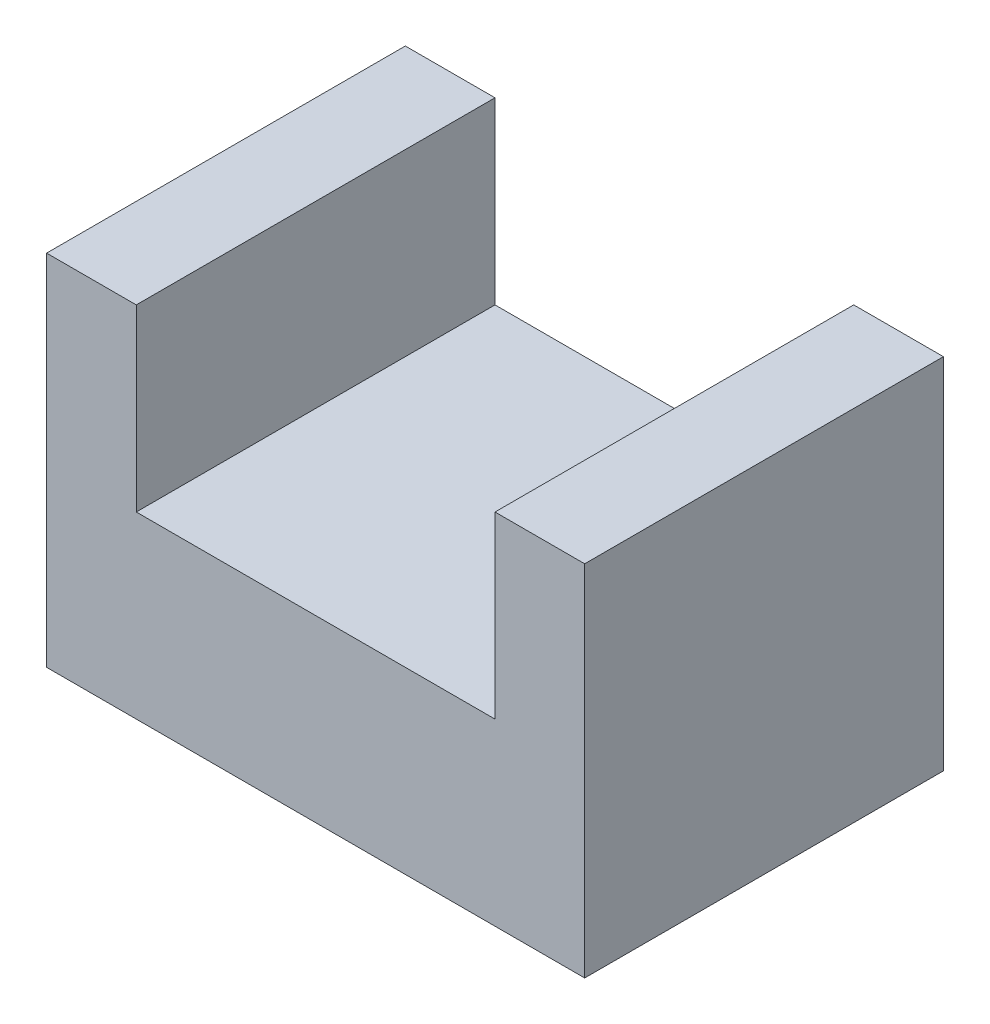
ISO-10303-21;
HEADER;
FILE_DESCRIPTION(('STEP AP214'),'2;1');
FILE_NAME('part.step','',(''),(''),'','','');
FILE_SCHEMA(('AUTOMOTIVE_DESIGN { 1 0 10303 214 1 1 1 1 }'));
ENDSEC;
DATA;
#1=APPLICATION_CONTEXT('core data for automotive mechanical design processes');
#2=APPLICATION_PROTOCOL_DEFINITION('international standard','automotive_design',2000,#1);
#3=PRODUCT_CONTEXT('',#1,'mechanical');
#4=PRODUCT('Part','Part','',(#3));
#5=PRODUCT_RELATED_PRODUCT_CATEGORY('part','',(#4));
#6=PRODUCT_DEFINITION_FORMATION('','',#4);
#7=PRODUCT_DEFINITION_CONTEXT('part definition',#1,'design');
#8=PRODUCT_DEFINITION('design','',#6,#7);
#9=PRODUCT_DEFINITION_SHAPE('','',#8);
#10=(LENGTH_UNIT() NAMED_UNIT(*) SI_UNIT(.MILLI.,.METRE.));
#11=(NAMED_UNIT(*) PLANE_ANGLE_UNIT() SI_UNIT($,.RADIAN.));
#12=(NAMED_UNIT(*) SI_UNIT($,.STERADIAN.) SOLID_ANGLE_UNIT());
#13=UNCERTAINTY_MEASURE_WITH_UNIT(LENGTH_MEASURE(1.E-05),#10,'distance_accuracy_value','');
#14=(GEOMETRIC_REPRESENTATION_CONTEXT(3) GLOBAL_UNCERTAINTY_ASSIGNED_CONTEXT((#13)) GLOBAL_UNIT_ASSIGNED_CONTEXT((#10,
#11,#12)) REPRESENTATION_CONTEXT('',''));
#15=CARTESIAN_POINT('',(0.,0.,0.));
#16=DIRECTION('',(0.,0.,1.));
#17=DIRECTION('',(1.,0.,0.));
#18=AXIS2_PLACEMENT_3D('',#15,#16,#17);
#19=CARTESIAN_POINT('',(-23.9150769230769,37.0449230769231,50.8));
#20=DIRECTION('',(0.,-1.,0.));
#21=DIRECTION('',(0.,0.,-1.));
#22=AXIS2_PLACEMENT_3D('',#19,#20,#21);
#23=PLANE('',#22);
#24=DIRECTION('',(-1.,0.,0.));
#25=VECTOR('',#24,1.);
#26=CARTESIAN_POINT('',(-23.9150769230769,37.0449230769231,0.));
#27=LINE('',#26,#25);
#28=CARTESIAN_POINT('',(-23.9150769230769,37.0449230769231,0.));
#29=VERTEX_POINT('',#28);
#30=CARTESIAN_POINT('',(-36.6150769230769,37.0449230769231,0.));
#31=VERTEX_POINT('',#30);
#32=EDGE_CURVE('E128',#29,#31,#27,.T.);
#33=ORIENTED_EDGE('',*,*,#32,.T.);
#34=DIRECTION('',(0.,0.,-1.));
#35=VECTOR('',#34,1.);
#36=CARTESIAN_POINT('',(-36.6150769230769,37.0449230769231,50.8));
#37=LINE('',#36,#35);
#38=CARTESIAN_POINT('',(-36.6150769230769,37.0449230769231,50.8));
#39=VERTEX_POINT('',#38);
#40=EDGE_CURVE('E11',#39,#31,#37,.T.);
#41=ORIENTED_EDGE('',*,*,#40,.F.);
#42=DIRECTION('',(-1.,0.,0.));
#43=VECTOR('',#42,1.);
#44=CARTESIAN_POINT('',(-23.9150769230769,37.0449230769231,50.8));
#45=LINE('',#44,#43);
#46=CARTESIAN_POINT('',(-23.9150769230769,37.0449230769231,50.8));
#47=VERTEX_POINT('',#46);
#48=EDGE_CURVE('E142',#47,#39,#45,.T.);
#49=ORIENTED_EDGE('',*,*,#48,.F.);
#50=DIRECTION('',(0.,0.,-1.));
#51=VECTOR('',#50,1.);
#52=CARTESIAN_POINT('',(-23.9150769230769,37.0449230769231,50.8));
#53=LINE('',#52,#51);
#54=EDGE_CURVE('E124',#47,#29,#53,.T.);
#55=ORIENTED_EDGE('',*,*,#54,.T.);
#56=EDGE_LOOP('',(#33,#41,#49,#55));
#57=FACE_BOUND('',#56,.T.);
#58=ADVANCED_FACE('F32',(#57),#23,.F.);
#59=CARTESIAN_POINT('',(-36.6150769230769,37.0449230769231,50.8));
#60=DIRECTION('',(1.,0.,0.));
#61=DIRECTION('',(0.,0.,-1.));
#62=AXIS2_PLACEMENT_3D('',#59,#60,#61);
#63=PLANE('',#62);
#64=DIRECTION('',(0.,-1.,0.));
#65=VECTOR('',#64,1.);
#66=CARTESIAN_POINT('',(-36.6150769230769,37.0449230769231,0.));
#67=LINE('',#66,#65);
#68=CARTESIAN_POINT('',(-36.6150769230769,-13.7550769230769,0.));
#69=VERTEX_POINT('',#68);
#70=EDGE_CURVE('E131',#31,#69,#67,.T.);
#71=ORIENTED_EDGE('',*,*,#70,.T.);
#72=DIRECTION('',(0.,0.,-1.));
#73=VECTOR('',#72,1.);
#74=CARTESIAN_POINT('',(-36.6150769230769,-13.7550769230769,50.8));
#75=LINE('',#74,#73);
#76=CARTESIAN_POINT('',(-36.6150769230769,-13.7550769230769,50.8));
#77=VERTEX_POINT('',#76);
#78=EDGE_CURVE('E40',#77,#69,#75,.T.);
#79=ORIENTED_EDGE('',*,*,#78,.F.);
#80=DIRECTION('',(0.,-1.,0.));
#81=VECTOR('',#80,1.);
#82=CARTESIAN_POINT('',(-36.6150769230769,37.0449230769231,50.8));
#83=LINE('',#82,#81);
#84=EDGE_CURVE('E91',#39,#77,#83,.T.);
#85=ORIENTED_EDGE('',*,*,#84,.F.);
#86=ORIENTED_EDGE('',*,*,#40,.T.);
#87=EDGE_LOOP('',(#71,#79,#85,#86));
#88=FACE_BOUND('',#87,.T.);
#89=ADVANCED_FACE('F177',(#88),#63,.F.);
#90=CARTESIAN_POINT('',(-36.6150769230769,-13.7550769230769,50.8));
#91=DIRECTION('',(0.,1.,0.));
#92=DIRECTION('',(0.,0.,1.));
#93=AXIS2_PLACEMENT_3D('',#90,#91,#92);
#94=PLANE('',#93);
#95=DIRECTION('',(1.,0.,0.));
#96=VECTOR('',#95,1.);
#97=CARTESIAN_POINT('',(-36.6150769230769,-13.7550769230769,0.));
#98=LINE('',#97,#96);
#99=CARTESIAN_POINT('',(39.5849230769231,-13.7550769230769,0.));
#100=VERTEX_POINT('',#99);
#101=EDGE_CURVE('E133',#69,#100,#98,.T.);
#102=ORIENTED_EDGE('',*,*,#101,.T.);
#103=DIRECTION('',(0.,0.,-1.));
#104=VECTOR('',#103,1.);
#105=CARTESIAN_POINT('',(39.5849230769231,-13.7550769230769,50.8));
#106=LINE('',#105,#104);
#107=CARTESIAN_POINT('',(39.5849230769231,-13.7550769230769,50.8));
#108=VERTEX_POINT('',#107);
#109=EDGE_CURVE('E149',#108,#100,#106,.T.);
#110=ORIENTED_EDGE('',*,*,#109,.F.);
#111=DIRECTION('',(1.,0.,0.));
#112=VECTOR('',#111,1.);
#113=CARTESIAN_POINT('',(-36.6150769230769,-13.7550769230769,50.8));
#114=LINE('',#113,#112);
#115=EDGE_CURVE('E157',#77,#108,#114,.T.);
#116=ORIENTED_EDGE('',*,*,#115,.F.);
#117=ORIENTED_EDGE('',*,*,#78,.T.);
#118=EDGE_LOOP('',(#102,#110,#116,#117));
#119=FACE_BOUND('',#118,.T.);
#120=ADVANCED_FACE('F155',(#119),#94,.F.);
#121=CARTESIAN_POINT('',(39.5849230769231,-13.7550769230769,50.8));
#122=DIRECTION('',(-1.,0.,0.));
#123=DIRECTION('',(0.,0.,1.));
#124=AXIS2_PLACEMENT_3D('',#121,#122,#123);
#125=PLANE('',#124);
#126=DIRECTION('',(0.,1.,0.));
#127=VECTOR('',#126,1.);
#128=CARTESIAN_POINT('',(39.5849230769231,-13.7550769230769,0.));
#129=LINE('',#128,#127);
#130=CARTESIAN_POINT('',(39.5849230769231,37.0449230769231,0.));
#131=VERTEX_POINT('',#130);
#132=EDGE_CURVE('E135',#100,#131,#129,.T.);
#133=ORIENTED_EDGE('',*,*,#132,.T.);
#134=DIRECTION('',(0.,0.,-1.));
#135=VECTOR('',#134,1.);
#136=CARTESIAN_POINT('',(39.5849230769231,37.0449230769231,50.8));
#137=LINE('',#136,#135);
#138=CARTESIAN_POINT('',(39.5849230769231,37.0449230769231,50.8));
#139=VERTEX_POINT('',#138);
#140=EDGE_CURVE('E146',#139,#131,#137,.T.);
#141=ORIENTED_EDGE('',*,*,#140,.F.);
#142=DIRECTION('',(0.,1.,0.));
#143=VECTOR('',#142,1.);
#144=CARTESIAN_POINT('',(39.5849230769231,-13.7550769230769,50.8));
#145=LINE('',#144,#143);
#146=EDGE_CURVE('E169',#108,#139,#145,.T.);
#147=ORIENTED_EDGE('',*,*,#146,.F.);
#148=ORIENTED_EDGE('',*,*,#109,.T.);
#149=EDGE_LOOP('',(#133,#141,#147,#148));
#150=FACE_BOUND('',#149,.T.);
#151=ADVANCED_FACE('F165',(#150),#125,.F.);
#152=CARTESIAN_POINT('',(39.5849230769231,37.0449230769231,50.8));
#153=DIRECTION('',(0.,-1.,0.));
#154=DIRECTION('',(0.,0.,-1.));
#155=AXIS2_PLACEMENT_3D('',#152,#153,#154);
#156=PLANE('',#155);
#157=DIRECTION('',(-1.,0.,0.));
#158=VECTOR('',#157,1.);
#159=CARTESIAN_POINT('',(39.5849230769231,37.0449230769231,0.));
#160=LINE('',#159,#158);
#161=CARTESIAN_POINT('',(26.8849230769231,37.0449230769231,0.));
#162=VERTEX_POINT('',#161);
#163=EDGE_CURVE('E137',#131,#162,#160,.T.);
#164=ORIENTED_EDGE('',*,*,#163,.T.);
#165=DIRECTION('',(0.,0.,-1.));
#166=VECTOR('',#165,1.);
#167=CARTESIAN_POINT('',(26.8849230769231,37.0449230769231,50.8));
#168=LINE('',#167,#166);
#169=CARTESIAN_POINT('',(26.8849230769231,37.0449230769231,50.8));
#170=VERTEX_POINT('',#169);
#171=EDGE_CURVE('E119',#170,#162,#168,.T.);
#172=ORIENTED_EDGE('',*,*,#171,.F.);
#173=DIRECTION('',(-1.,0.,0.));
#174=VECTOR('',#173,1.);
#175=CARTESIAN_POINT('',(39.5849230769231,37.0449230769231,50.8));
#176=LINE('',#175,#174);
#177=EDGE_CURVE('E110',#139,#170,#176,.T.);
#178=ORIENTED_EDGE('',*,*,#177,.F.);
#179=ORIENTED_EDGE('',*,*,#140,.T.);
#180=EDGE_LOOP('',(#164,#172,#178,#179));
#181=FACE_BOUND('',#180,.T.);
#182=ADVANCED_FACE('F168',(#181),#156,.F.);
#183=CARTESIAN_POINT('',(26.8849230769231,37.0449230769231,50.8));
#184=DIRECTION('',(1.,0.,0.));
#185=DIRECTION('',(0.,0.,-1.));
#186=AXIS2_PLACEMENT_3D('',#183,#184,#185);
#187=PLANE('',#186);
#188=DIRECTION('',(0.,-1.,0.));
#189=VECTOR('',#188,1.);
#190=CARTESIAN_POINT('',(26.8849230769231,37.0449230769231,0.));
#191=LINE('',#190,#189);
#192=CARTESIAN_POINT('',(26.8849230769231,11.6449230769231,0.));
#193=VERTEX_POINT('',#192);
#194=EDGE_CURVE('E118',#162,#193,#191,.T.);
#195=ORIENTED_EDGE('',*,*,#194,.T.);
#196=DIRECTION('',(0.,0.,-1.));
#197=VECTOR('',#196,1.);
#198=CARTESIAN_POINT('',(26.8849230769231,11.6449230769231,50.8));
#199=LINE('',#198,#197);
#200=CARTESIAN_POINT('',(26.8849230769231,11.6449230769231,50.8));
#201=VERTEX_POINT('',#200);
#202=EDGE_CURVE('E115',#201,#193,#199,.T.);
#203=ORIENTED_EDGE('',*,*,#202,.F.);
#204=DIRECTION('',(0.,-1.,0.));
#205=VECTOR('',#204,1.);
#206=CARTESIAN_POINT('',(26.8849230769231,37.0449230769231,50.8));
#207=LINE('',#206,#205);
#208=EDGE_CURVE('E104',#170,#201,#207,.T.);
#209=ORIENTED_EDGE('',*,*,#208,.F.);
#210=ORIENTED_EDGE('',*,*,#171,.T.);
#211=EDGE_LOOP('',(#195,#203,#209,#210));
#212=FACE_BOUND('',#211,.T.);
#213=ADVANCED_FACE('F116',(#212),#187,.F.);
#214=CARTESIAN_POINT('',(26.8849230769231,11.6449230769231,50.8));
#215=DIRECTION('',(0.,-1.,0.));
#216=DIRECTION('',(1.,0.,0.));
#217=AXIS2_PLACEMENT_3D('',#214,#215,#216);
#218=PLANE('',#217);
#219=DIRECTION('',(-1.,0.,0.));
#220=VECTOR('',#219,1.);
#221=CARTESIAN_POINT('',(26.8849230769231,11.6449230769231,0.));
#222=LINE('',#221,#220);
#223=CARTESIAN_POINT('',(-23.9150769230769,11.6449230769231,0.));
#224=VERTEX_POINT('',#223);
#225=EDGE_CURVE('E77',#193,#224,#222,.T.);
#226=ORIENTED_EDGE('',*,*,#225,.T.);
#227=DIRECTION('',(0.,0.,-1.));
#228=VECTOR('',#227,1.);
#229=CARTESIAN_POINT('',(-23.9150769230769,11.6449230769231,50.8));
#230=LINE('',#229,#228);
#231=CARTESIAN_POINT('',(-23.9150769230769,11.6449230769231,50.8));
#232=VERTEX_POINT('',#231);
#233=EDGE_CURVE('E120',#232,#224,#230,.T.);
#234=ORIENTED_EDGE('',*,*,#233,.F.);
#235=DIRECTION('',(-1.,0.,0.));
#236=VECTOR('',#235,1.);
#237=CARTESIAN_POINT('',(26.8849230769231,11.6449230769231,50.8));
#238=LINE('',#237,#236);
#239=EDGE_CURVE('E108',#201,#232,#238,.T.);
#240=ORIENTED_EDGE('',*,*,#239,.F.);
#241=ORIENTED_EDGE('',*,*,#202,.T.);
#242=EDGE_LOOP('',(#226,#234,#240,#241));
#243=FACE_BOUND('',#242,.T.);
#244=ADVANCED_FACE('F122',(#243),#218,.F.);
#245=CARTESIAN_POINT('',(-23.9150769230769,11.6449230769231,50.8));
#246=DIRECTION('',(-1.,0.,0.));
#247=DIRECTION('',(0.,0.,1.));
#248=AXIS2_PLACEMENT_3D('',#245,#246,#247);
#249=PLANE('',#248);
#250=DIRECTION('',(0.,1.,0.));
#251=VECTOR('',#250,1.);
#252=CARTESIAN_POINT('',(-23.9150769230769,11.6449230769231,0.));
#253=LINE('',#252,#251);
#254=EDGE_CURVE('E83',#224,#29,#253,.T.);
#255=ORIENTED_EDGE('',*,*,#254,.T.);
#256=ORIENTED_EDGE('',*,*,#54,.F.);
#257=DIRECTION('',(0.,1.,0.));
#258=VECTOR('',#257,1.);
#259=CARTESIAN_POINT('',(-23.9150769230769,11.6449230769231,50.8));
#260=LINE('',#259,#258);
#261=EDGE_CURVE('E48',#232,#47,#260,.T.);
#262=ORIENTED_EDGE('',*,*,#261,.F.);
#263=ORIENTED_EDGE('',*,*,#233,.T.);
#264=EDGE_LOOP('',(#255,#256,#262,#263));
#265=FACE_BOUND('',#264,.T.);
#266=ADVANCED_FACE('F193',(#265),#249,.F.);
#267=CARTESIAN_POINT('',(0.,0.,50.8));
#268=DIRECTION('',(0.,0.,1.));
#269=DIRECTION('',(1.,0.,0.));
#270=AXIS2_PLACEMENT_3D('',#267,#268,#269);
#271=PLANE('',#270);
#272=ORIENTED_EDGE('',*,*,#48,.T.);
#273=ORIENTED_EDGE('',*,*,#84,.T.);
#274=ORIENTED_EDGE('',*,*,#115,.T.);
#275=ORIENTED_EDGE('',*,*,#146,.T.);
#276=ORIENTED_EDGE('',*,*,#177,.T.);
#277=ORIENTED_EDGE('',*,*,#208,.T.);
#278=ORIENTED_EDGE('',*,*,#239,.T.);
#279=ORIENTED_EDGE('',*,*,#261,.T.);
#280=EDGE_LOOP('',(#272,#273,#274,#275,#276,#277,#278,#279));
#281=FACE_BOUND('',#280,.T.);
#282=ADVANCED_FACE('F106',(#281),#271,.T.);
#283=CARTESIAN_POINT('',(0.,0.,0.));
#284=DIRECTION('',(0.,0.,1.));
#285=DIRECTION('',(1.,0.,0.));
#286=AXIS2_PLACEMENT_3D('',#283,#284,#285);
#287=PLANE('',#286);
#288=ORIENTED_EDGE('',*,*,#32,.F.);
#289=ORIENTED_EDGE('',*,*,#254,.F.);
#290=ORIENTED_EDGE('',*,*,#225,.F.);
#291=ORIENTED_EDGE('',*,*,#194,.F.);
#292=ORIENTED_EDGE('',*,*,#163,.F.);
#293=ORIENTED_EDGE('',*,*,#132,.F.);
#294=ORIENTED_EDGE('',*,*,#101,.F.);
#295=ORIENTED_EDGE('',*,*,#70,.F.);
#296=EDGE_LOOP('',(#288,#289,#290,#291,#292,#293,#294,#295));
#297=FACE_BOUND('',#296,.T.);
#298=ADVANCED_FACE('F161',(#297),#287,.F.);
#299=CLOSED_SHELL('',(#58,#89,#120,#151,#182,#213,#244,#266,#282,#298));
#300=MANIFOLD_SOLID_BREP('B2',#299);
#301=ADVANCED_BREP_SHAPE_REPRESENTATION('',(#18,#300),#14);
#302=SHAPE_DEFINITION_REPRESENTATION(#9,#301);
ENDSEC;
END-ISO-10303-21;
